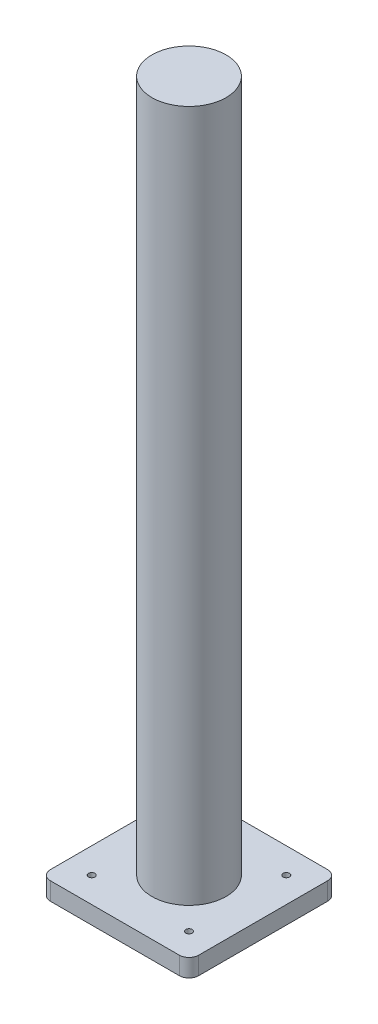
ISO-10303-21;
HEADER;
FILE_DESCRIPTION(('STEP AP214'),'2;1');
FILE_NAME('part.step','',(''),(''),'','','');
FILE_SCHEMA(('AUTOMOTIVE_DESIGN { 1 0 10303 214 1 1 1 1 }'));
ENDSEC;
DATA;
#1=APPLICATION_CONTEXT('core data for automotive mechanical design processes');
#2=APPLICATION_PROTOCOL_DEFINITION('international standard','automotive_design',2000,#1);
#3=PRODUCT_CONTEXT('',#1,'mechanical');
#4=PRODUCT('Part','Part','',(#3));
#5=PRODUCT_RELATED_PRODUCT_CATEGORY('part','',(#4));
#6=PRODUCT_DEFINITION_FORMATION('','',#4);
#7=PRODUCT_DEFINITION_CONTEXT('part definition',#1,'design');
#8=PRODUCT_DEFINITION('design','',#6,#7);
#9=PRODUCT_DEFINITION_SHAPE('','',#8);
#10=(LENGTH_UNIT() NAMED_UNIT(*) SI_UNIT(.MILLI.,.METRE.));
#11=(NAMED_UNIT(*) PLANE_ANGLE_UNIT() SI_UNIT($,.RADIAN.));
#12=(NAMED_UNIT(*) SI_UNIT($,.STERADIAN.) SOLID_ANGLE_UNIT());
#13=UNCERTAINTY_MEASURE_WITH_UNIT(LENGTH_MEASURE(1.E-05),#10,'distance_accuracy_value','');
#14=(GEOMETRIC_REPRESENTATION_CONTEXT(3) GLOBAL_UNCERTAINTY_ASSIGNED_CONTEXT((#13)) GLOBAL_UNIT_ASSIGNED_CONTEXT((#10,
#11,#12)) REPRESENTATION_CONTEXT('',''));
#15=CARTESIAN_POINT('',(0.,0.,0.));
#16=DIRECTION('',(0.,0.,1.));
#17=DIRECTION('',(1.,0.,0.));
#18=AXIS2_PLACEMENT_3D('',#15,#16,#17);
#19=CARTESIAN_POINT('',(0.,9.144,0.));
#20=DIRECTION('',(1.,0.,0.));
#21=DIRECTION('',(0.,0.,-1.));
#22=AXIS2_PLACEMENT_3D('',#19,#20,#21);
#23=PLANE('',#22);
#24=DIRECTION('',(0.,0.,1.));
#25=VECTOR('',#24,1.);
#26=CARTESIAN_POINT('',(0.,9.144,0.));
#27=LINE('',#26,#25);
#28=CARTESIAN_POINT('',(0.,9.144,-71.2));
#29=VERTEX_POINT('',#28);
#30=CARTESIAN_POINT('',(0.,9.144,-5.));
#31=VERTEX_POINT('',#30);
#32=EDGE_CURVE('E130',#29,#31,#27,.T.);
#33=ORIENTED_EDGE('',*,*,#32,.F.);
#34=DIRECTION('',(0.,-1.,0.));
#35=VECTOR('',#34,1.);
#36=CARTESIAN_POINT('',(0.,9.144,-71.2));
#37=LINE('',#36,#35);
#38=CARTESIAN_POINT('',(0.,0.,-71.2));
#39=VERTEX_POINT('',#38);
#40=EDGE_CURVE('E115',#29,#39,#37,.T.);
#41=ORIENTED_EDGE('',*,*,#40,.T.);
#42=DIRECTION('',(0.,0.,1.));
#43=VECTOR('',#42,1.);
#44=CARTESIAN_POINT('',(0.,0.,0.));
#45=LINE('',#44,#43);
#46=CARTESIAN_POINT('',(0.,0.,-5.));
#47=VERTEX_POINT('',#46);
#48=EDGE_CURVE('E127',#39,#47,#45,.T.);
#49=ORIENTED_EDGE('',*,*,#48,.T.);
#50=DIRECTION('',(0.,-1.,0.));
#51=VECTOR('',#50,1.);
#52=CARTESIAN_POINT('',(0.,9.144,-5.));
#53=LINE('',#52,#51);
#54=EDGE_CURVE('E132',#47,#31,#53,.F.);
#55=ORIENTED_EDGE('',*,*,#54,.T.);
#56=EDGE_LOOP('',(#33,#41,#49,#55));
#57=FACE_BOUND('',#56,.T.);
#58=ADVANCED_FACE('F45',(#57),#23,.F.);
#59=CARTESIAN_POINT('',(0.,9.144,0.));
#60=DIRECTION('',(0.,0.,-1.));
#61=DIRECTION('',(-1.,0.,0.));
#62=AXIS2_PLACEMENT_3D('',#59,#60,#61);
#63=PLANE('',#62);
#64=DIRECTION('',(1.,0.,0.));
#65=VECTOR('',#64,1.);
#66=CARTESIAN_POINT('',(0.,0.,0.));
#67=LINE('',#66,#65);
#68=CARTESIAN_POINT('',(5.,0.,0.));
#69=VERTEX_POINT('',#68);
#70=CARTESIAN_POINT('',(71.2,0.,0.));
#71=VERTEX_POINT('',#70);
#72=EDGE_CURVE('E136',#69,#71,#67,.T.);
#73=ORIENTED_EDGE('',*,*,#72,.T.);
#74=DIRECTION('',(0.,-1.,0.));
#75=VECTOR('',#74,1.);
#76=CARTESIAN_POINT('',(71.2,9.144,0.));
#77=LINE('',#76,#75);
#78=CARTESIAN_POINT('',(71.2,9.144,0.));
#79=VERTEX_POINT('',#78);
#80=EDGE_CURVE('E11',#71,#79,#77,.F.);
#81=ORIENTED_EDGE('',*,*,#80,.T.);
#82=DIRECTION('',(1.,0.,0.));
#83=VECTOR('',#82,1.);
#84=CARTESIAN_POINT('',(0.,9.144,0.));
#85=LINE('',#84,#83);
#86=CARTESIAN_POINT('',(5.,9.144,0.));
#87=VERTEX_POINT('',#86);
#88=EDGE_CURVE('E179',#87,#79,#85,.T.);
#89=ORIENTED_EDGE('',*,*,#88,.F.);
#90=DIRECTION('',(0.,-1.,0.));
#91=VECTOR('',#90,1.);
#92=CARTESIAN_POINT('',(5.,9.144,0.));
#93=LINE('',#92,#91);
#94=EDGE_CURVE('E53',#87,#69,#93,.T.);
#95=ORIENTED_EDGE('',*,*,#94,.T.);
#96=EDGE_LOOP('',(#73,#81,#89,#95));
#97=FACE_BOUND('',#96,.T.);
#98=ADVANCED_FACE('F177',(#97),#63,.F.);
#99=CARTESIAN_POINT('',(76.2,9.144,0.));
#100=DIRECTION('',(-1.,0.,0.));
#101=DIRECTION('',(0.,0.,1.));
#102=AXIS2_PLACEMENT_3D('',#99,#100,#101);
#103=PLANE('',#102);
#104=DIRECTION('',(0.,0.,-1.));
#105=VECTOR('',#104,1.);
#106=CARTESIAN_POINT('',(76.2,0.,0.));
#107=LINE('',#106,#105);
#108=CARTESIAN_POINT('',(76.2,0.,-5.));
#109=VERTEX_POINT('',#108);
#110=CARTESIAN_POINT('',(76.2,0.,-71.2));
#111=VERTEX_POINT('',#110);
#112=EDGE_CURVE('E140',#109,#111,#107,.T.);
#113=ORIENTED_EDGE('',*,*,#112,.T.);
#114=DIRECTION('',(0.,-1.,0.));
#115=VECTOR('',#114,1.);
#116=CARTESIAN_POINT('',(76.2,9.144,-71.2));
#117=LINE('',#116,#115);
#118=CARTESIAN_POINT('',(76.2,9.144,-71.2));
#119=VERTEX_POINT('',#118);
#120=EDGE_CURVE('E60',#111,#119,#117,.F.);
#121=ORIENTED_EDGE('',*,*,#120,.T.);
#122=DIRECTION('',(0.,0.,-1.));
#123=VECTOR('',#122,1.);
#124=CARTESIAN_POINT('',(76.2,9.144,0.));
#125=LINE('',#124,#123);
#126=CARTESIAN_POINT('',(76.2,9.144,-5.));
#127=VERTEX_POINT('',#126);
#128=EDGE_CURVE('E187',#127,#119,#125,.T.);
#129=ORIENTED_EDGE('',*,*,#128,.F.);
#130=DIRECTION('',(0.,-1.,0.));
#131=VECTOR('',#130,1.);
#132=CARTESIAN_POINT('',(76.2,9.144,-5.));
#133=LINE('',#132,#131);
#134=EDGE_CURVE('E170',#127,#109,#133,.T.);
#135=ORIENTED_EDGE('',*,*,#134,.T.);
#136=EDGE_LOOP('',(#113,#121,#129,#135));
#137=FACE_BOUND('',#136,.T.);
#138=ADVANCED_FACE('F186',(#137),#103,.F.);
#139=CARTESIAN_POINT('',(0.,9.144,-76.2));
#140=DIRECTION('',(0.,0.,1.));
#141=DIRECTION('',(1.,0.,0.));
#142=AXIS2_PLACEMENT_3D('',#139,#140,#141);
#143=PLANE('',#142);
#144=DIRECTION('',(-1.,0.,0.));
#145=VECTOR('',#144,1.);
#146=CARTESIAN_POINT('',(0.,0.,-76.2));
#147=LINE('',#146,#145);
#148=CARTESIAN_POINT('',(71.2,0.,-76.2));
#149=VERTEX_POINT('',#148);
#150=CARTESIAN_POINT('',(5.,0.,-76.2));
#151=VERTEX_POINT('',#150);
#152=EDGE_CURVE('E150',#149,#151,#147,.T.);
#153=ORIENTED_EDGE('',*,*,#152,.T.);
#154=DIRECTION('',(0.,-1.,0.));
#155=VECTOR('',#154,1.);
#156=CARTESIAN_POINT('',(5.,9.144,-76.2));
#157=LINE('',#156,#155);
#158=CARTESIAN_POINT('',(5.,9.144,-76.2));
#159=VERTEX_POINT('',#158);
#160=EDGE_CURVE('E116',#151,#159,#157,.F.);
#161=ORIENTED_EDGE('',*,*,#160,.T.);
#162=DIRECTION('',(-1.,0.,0.));
#163=VECTOR('',#162,1.);
#164=CARTESIAN_POINT('',(0.,9.144,-76.2));
#165=LINE('',#164,#163);
#166=CARTESIAN_POINT('',(71.2,9.144,-76.2));
#167=VERTEX_POINT('',#166);
#168=EDGE_CURVE('E146',#167,#159,#165,.T.);
#169=ORIENTED_EDGE('',*,*,#168,.F.);
#170=DIRECTION('',(0.,-1.,0.));
#171=VECTOR('',#170,1.);
#172=CARTESIAN_POINT('',(71.2,9.144,-76.2));
#173=LINE('',#172,#171);
#174=EDGE_CURVE('E121',#167,#149,#173,.T.);
#175=ORIENTED_EDGE('',*,*,#174,.T.);
#176=EDGE_LOOP('',(#153,#161,#169,#175));
#177=FACE_BOUND('',#176,.T.);
#178=ADVANCED_FACE('F229',(#177),#143,.F.);
#179=CARTESIAN_POINT('',(0.,9.144,0.));
#180=DIRECTION('',(0.,-1.,0.));
#181=DIRECTION('',(0.,0.,-1.));
#182=AXIS2_PLACEMENT_3D('',#179,#180,#181);
#183=PLANE('',#182);
#184=CARTESIAN_POINT('',(38.1,9.14399999999999,-38.1));
#185=DIRECTION('',(0.,-1.,0.));
#186=DIRECTION('',(0.,0.,-1.));
#187=AXIS2_PLACEMENT_3D('',#184,#185,#186);
#188=CIRCLE('',#187,19.05);
#189=CARTESIAN_POINT('',(38.1,9.14399999999999,-57.15));
#190=VERTEX_POINT('',#189);
#191=EDGE_CURVE('E152',#190,#190,#188,.F.);
#192=ORIENTED_EDGE('',*,*,#191,.F.);
#193=EDGE_LOOP('',(#192));
#194=FACE_BOUND('',#193,.T.);
#195=CARTESIAN_POINT('',(13.1,9.144,-63.1));
#196=DIRECTION('',(0.,1.,0.));
#197=DIRECTION('',(0.,0.,1.));
#198=AXIS2_PLACEMENT_3D('',#195,#196,#197);
#199=CIRCLE('',#198,1.65);
#200=CARTESIAN_POINT('',(13.1,9.144,-61.45));
#201=VERTEX_POINT('',#200);
#202=EDGE_CURVE('E203',#201,#201,#199,.T.);
#203=ORIENTED_EDGE('',*,*,#202,.F.);
#204=EDGE_LOOP('',(#203));
#205=FACE_BOUND('',#204,.T.);
#206=CARTESIAN_POINT('',(63.1,9.144,-13.1));
#207=DIRECTION('',(0.,1.,0.));
#208=DIRECTION('',(0.,0.,1.));
#209=AXIS2_PLACEMENT_3D('',#206,#207,#208);
#210=CIRCLE('',#209,1.65);
#211=CARTESIAN_POINT('',(63.1,9.144,-11.45));
#212=VERTEX_POINT('',#211);
#213=EDGE_CURVE('E196',#212,#212,#210,.T.);
#214=ORIENTED_EDGE('',*,*,#213,.F.);
#215=EDGE_LOOP('',(#214));
#216=FACE_BOUND('',#215,.T.);
#217=CARTESIAN_POINT('',(13.1,9.144,-13.1));
#218=DIRECTION('',(0.,1.,0.));
#219=DIRECTION('',(0.,0.,1.));
#220=AXIS2_PLACEMENT_3D('',#217,#218,#219);
#221=CIRCLE('',#220,1.65);
#222=CARTESIAN_POINT('',(13.1,9.144,-11.45));
#223=VERTEX_POINT('',#222);
#224=EDGE_CURVE('E208',#223,#223,#221,.T.);
#225=ORIENTED_EDGE('',*,*,#224,.F.);
#226=EDGE_LOOP('',(#225));
#227=FACE_BOUND('',#226,.T.);
#228=CARTESIAN_POINT('',(63.1,9.144,-63.1));
#229=DIRECTION('',(0.,1.,0.));
#230=DIRECTION('',(0.,0.,1.));
#231=AXIS2_PLACEMENT_3D('',#228,#229,#230);
#232=CIRCLE('',#231,1.65);
#233=CARTESIAN_POINT('',(63.1,9.144,-61.45));
#234=VERTEX_POINT('',#233);
#235=EDGE_CURVE('E143',#234,#234,#232,.T.);
#236=ORIENTED_EDGE('',*,*,#235,.F.);
#237=EDGE_LOOP('',(#236));
#238=FACE_BOUND('',#237,.T.);
#239=ORIENTED_EDGE('',*,*,#168,.T.);
#240=CARTESIAN_POINT('',(5.,9.144,-71.2));
#241=DIRECTION('',(0.,-1.,0.));
#242=DIRECTION('',(0.,0.,-1.));
#243=AXIS2_PLACEMENT_3D('',#240,#241,#242);
#244=CIRCLE('',#243,5.);
#245=EDGE_CURVE('E168',#159,#29,#244,.F.);
#246=ORIENTED_EDGE('',*,*,#245,.T.);
#247=ORIENTED_EDGE('',*,*,#32,.T.);
#248=CARTESIAN_POINT('',(5.,9.144,-5.));
#249=DIRECTION('',(0.,-1.,0.));
#250=DIRECTION('',(0.,0.,-1.));
#251=AXIS2_PLACEMENT_3D('',#248,#249,#250);
#252=CIRCLE('',#251,5.);
#253=EDGE_CURVE('E163',#31,#87,#252,.F.);
#254=ORIENTED_EDGE('',*,*,#253,.T.);
#255=ORIENTED_EDGE('',*,*,#88,.T.);
#256=CARTESIAN_POINT('',(71.2,9.144,-5.));
#257=DIRECTION('',(0.,-1.,0.));
#258=DIRECTION('',(0.,0.,-1.));
#259=AXIS2_PLACEMENT_3D('',#256,#257,#258);
#260=CIRCLE('',#259,5.);
#261=EDGE_CURVE('E67',#79,#127,#260,.F.);
#262=ORIENTED_EDGE('',*,*,#261,.T.);
#263=ORIENTED_EDGE('',*,*,#128,.T.);
#264=CARTESIAN_POINT('',(71.2,9.144,-71.2));
#265=DIRECTION('',(0.,-1.,0.));
#266=DIRECTION('',(0.,0.,-1.));
#267=AXIS2_PLACEMENT_3D('',#264,#265,#266);
#268=CIRCLE('',#267,5.);
#269=EDGE_CURVE('E166',#119,#167,#268,.F.);
#270=ORIENTED_EDGE('',*,*,#269,.T.);
#271=EDGE_LOOP('',(#239,#246,#247,#254,#255,#262,#263,#270));
#272=FACE_BOUND('',#271,.T.);
#273=ADVANCED_FACE('F226',(#194,#205,#216,#227,#238,#272),#183,.F.);
#274=CARTESIAN_POINT('',(0.,0.,0.));
#275=DIRECTION('',(0.,-1.,0.));
#276=DIRECTION('',(0.,0.,-1.));
#277=AXIS2_PLACEMENT_3D('',#274,#275,#276);
#278=PLANE('',#277);
#279=CARTESIAN_POINT('',(13.1,0.,-63.1));
#280=DIRECTION('',(0.,1.,0.));
#281=DIRECTION('',(0.,0.,1.));
#282=AXIS2_PLACEMENT_3D('',#279,#280,#281);
#283=CIRCLE('',#282,1.65);
#284=CARTESIAN_POINT('',(13.1,0.,-61.45));
#285=VERTEX_POINT('',#284);
#286=EDGE_CURVE('E194',#285,#285,#283,.T.);
#287=ORIENTED_EDGE('',*,*,#286,.T.);
#288=EDGE_LOOP('',(#287));
#289=FACE_BOUND('',#288,.T.);
#290=CARTESIAN_POINT('',(63.1,0.,-13.1));
#291=DIRECTION('',(0.,1.,0.));
#292=DIRECTION('',(0.,0.,1.));
#293=AXIS2_PLACEMENT_3D('',#290,#291,#292);
#294=CIRCLE('',#293,1.65);
#295=CARTESIAN_POINT('',(63.1,0.,-11.45));
#296=VERTEX_POINT('',#295);
#297=EDGE_CURVE('E199',#296,#296,#294,.T.);
#298=ORIENTED_EDGE('',*,*,#297,.T.);
#299=EDGE_LOOP('',(#298));
#300=FACE_BOUND('',#299,.T.);
#301=CARTESIAN_POINT('',(13.1,0.,-13.1));
#302=DIRECTION('',(0.,1.,0.));
#303=DIRECTION('',(0.,0.,1.));
#304=AXIS2_PLACEMENT_3D('',#301,#302,#303);
#305=CIRCLE('',#304,1.65);
#306=CARTESIAN_POINT('',(13.1,0.,-11.45));
#307=VERTEX_POINT('',#306);
#308=EDGE_CURVE('E200',#307,#307,#305,.T.);
#309=ORIENTED_EDGE('',*,*,#308,.T.);
#310=EDGE_LOOP('',(#309));
#311=FACE_BOUND('',#310,.T.);
#312=CARTESIAN_POINT('',(63.1,0.,-63.1));
#313=DIRECTION('',(0.,1.,0.));
#314=DIRECTION('',(0.,0.,1.));
#315=AXIS2_PLACEMENT_3D('',#312,#313,#314);
#316=CIRCLE('',#315,1.65);
#317=CARTESIAN_POINT('',(63.1,0.,-61.45));
#318=VERTEX_POINT('',#317);
#319=EDGE_CURVE('E137',#318,#318,#316,.T.);
#320=ORIENTED_EDGE('',*,*,#319,.T.);
#321=EDGE_LOOP('',(#320));
#322=FACE_BOUND('',#321,.T.);
#323=ORIENTED_EDGE('',*,*,#48,.F.);
#324=CARTESIAN_POINT('',(5.,0.,-71.2));
#325=DIRECTION('',(0.,-1.,0.));
#326=DIRECTION('',(0.,0.,-1.));
#327=AXIS2_PLACEMENT_3D('',#324,#325,#326);
#328=CIRCLE('',#327,5.);
#329=EDGE_CURVE('E111',#39,#151,#328,.T.);
#330=ORIENTED_EDGE('',*,*,#329,.T.);
#331=ORIENTED_EDGE('',*,*,#152,.F.);
#332=CARTESIAN_POINT('',(71.2,0.,-71.2));
#333=DIRECTION('',(0.,-1.,0.));
#334=DIRECTION('',(0.,0.,-1.));
#335=AXIS2_PLACEMENT_3D('',#332,#333,#334);
#336=CIRCLE('',#335,5.);
#337=EDGE_CURVE('E122',#149,#111,#336,.T.);
#338=ORIENTED_EDGE('',*,*,#337,.T.);
#339=ORIENTED_EDGE('',*,*,#112,.F.);
#340=CARTESIAN_POINT('',(71.2,0.,-5.));
#341=DIRECTION('',(0.,-1.,0.));
#342=DIRECTION('',(0.,0.,-1.));
#343=AXIS2_PLACEMENT_3D('',#340,#341,#342);
#344=CIRCLE('',#343,5.);
#345=EDGE_CURVE('E157',#109,#71,#344,.T.);
#346=ORIENTED_EDGE('',*,*,#345,.T.);
#347=ORIENTED_EDGE('',*,*,#72,.F.);
#348=CARTESIAN_POINT('',(5.,0.,-5.));
#349=DIRECTION('',(0.,-1.,0.));
#350=DIRECTION('',(0.,0.,-1.));
#351=AXIS2_PLACEMENT_3D('',#348,#349,#350);
#352=CIRCLE('',#351,5.);
#353=EDGE_CURVE('E131',#69,#47,#352,.T.);
#354=ORIENTED_EDGE('',*,*,#353,.T.);
#355=EDGE_LOOP('',(#323,#330,#331,#338,#339,#346,#347,#354));
#356=FACE_BOUND('',#355,.T.);
#357=ADVANCED_FACE('F134',(#289,#300,#311,#322,#356),#278,.T.);
#358=CARTESIAN_POINT('',(63.1,0.,-63.1));
#359=DIRECTION('',(0.,1.,0.));
#360=DIRECTION('',(0.,0.,1.));
#361=AXIS2_PLACEMENT_3D('',#358,#359,#360);
#362=CYLINDRICAL_SURFACE('',#361,1.65);
#363=ORIENTED_EDGE('',*,*,#319,.F.);
#364=EDGE_LOOP('',(#363));
#365=FACE_BOUND('',#364,.T.);
#366=ORIENTED_EDGE('',*,*,#235,.T.);
#367=EDGE_LOOP('',(#366));
#368=FACE_BOUND('',#367,.T.);
#369=ADVANCED_FACE('F262',(#365,#368),#362,.F.);
#370=CARTESIAN_POINT('',(13.1,0.,-13.1));
#371=DIRECTION('',(0.,1.,0.));
#372=DIRECTION('',(0.,0.,1.));
#373=AXIS2_PLACEMENT_3D('',#370,#371,#372);
#374=CYLINDRICAL_SURFACE('',#373,1.65);
#375=ORIENTED_EDGE('',*,*,#308,.F.);
#376=EDGE_LOOP('',(#375));
#377=FACE_BOUND('',#376,.T.);
#378=ORIENTED_EDGE('',*,*,#224,.T.);
#379=EDGE_LOOP('',(#378));
#380=FACE_BOUND('',#379,.T.);
#381=ADVANCED_FACE('F267',(#377,#380),#374,.F.);
#382=CARTESIAN_POINT('',(63.1,0.,-13.1));
#383=DIRECTION('',(0.,1.,0.));
#384=DIRECTION('',(0.,0.,1.));
#385=AXIS2_PLACEMENT_3D('',#382,#383,#384);
#386=CYLINDRICAL_SURFACE('',#385,1.65);
#387=ORIENTED_EDGE('',*,*,#297,.F.);
#388=EDGE_LOOP('',(#387));
#389=FACE_BOUND('',#388,.T.);
#390=ORIENTED_EDGE('',*,*,#213,.T.);
#391=EDGE_LOOP('',(#390));
#392=FACE_BOUND('',#391,.T.);
#393=ADVANCED_FACE('F269',(#389,#392),#386,.F.);
#394=CARTESIAN_POINT('',(13.1,0.,-63.1));
#395=DIRECTION('',(0.,1.,0.));
#396=DIRECTION('',(0.,0.,1.));
#397=AXIS2_PLACEMENT_3D('',#394,#395,#396);
#398=CYLINDRICAL_SURFACE('',#397,1.65);
#399=ORIENTED_EDGE('',*,*,#286,.F.);
#400=EDGE_LOOP('',(#399));
#401=FACE_BOUND('',#400,.T.);
#402=ORIENTED_EDGE('',*,*,#202,.T.);
#403=EDGE_LOOP('',(#402));
#404=FACE_BOUND('',#403,.T.);
#405=ADVANCED_FACE('F222',(#401,#404),#398,.F.);
#406=CARTESIAN_POINT('',(38.1,364.744,-38.1));
#407=DIRECTION('',(0.,-1.,0.));
#408=DIRECTION('',(0.,0.,-1.));
#409=AXIS2_PLACEMENT_3D('',#406,#407,#408);
#410=CYLINDRICAL_SURFACE('',#409,19.05);
#411=CARTESIAN_POINT('',(38.1,364.744,-38.1));
#412=DIRECTION('',(0.,1.,0.));
#413=DIRECTION('',(0.,0.,1.));
#414=AXIS2_PLACEMENT_3D('',#411,#412,#413);
#415=CIRCLE('',#414,19.05);
#416=CARTESIAN_POINT('',(38.1,364.744,-19.05));
#417=VERTEX_POINT('',#416);
#418=EDGE_CURVE('E211',#417,#417,#415,.T.);
#419=ORIENTED_EDGE('',*,*,#418,.F.);
#420=EDGE_LOOP('',(#419));
#421=FACE_BOUND('',#420,.T.);
#422=ORIENTED_EDGE('',*,*,#191,.T.);
#423=EDGE_LOOP('',(#422));
#424=FACE_BOUND('',#423,.T.);
#425=ADVANCED_FACE('F219',(#421,#424),#410,.T.);
#426=CARTESIAN_POINT('',(38.1,364.744,-38.1));
#427=DIRECTION('',(0.,1.,0.));
#428=DIRECTION('',(0.,0.,1.));
#429=AXIS2_PLACEMENT_3D('',#426,#427,#428);
#430=PLANE('',#429);
#431=ORIENTED_EDGE('',*,*,#418,.T.);
#432=EDGE_LOOP('',(#431));
#433=FACE_BOUND('',#432,.T.);
#434=ADVANCED_FACE('F217',(#433),#430,.T.);
#435=CARTESIAN_POINT('',(5.,9.144,-71.2));
#436=DIRECTION('',(0.,-1.,0.));
#437=DIRECTION('',(0.,0.,-1.));
#438=AXIS2_PLACEMENT_3D('',#435,#436,#437);
#439=CYLINDRICAL_SURFACE('',#438,5.);
#440=ORIENTED_EDGE('',*,*,#245,.F.);
#441=ORIENTED_EDGE('',*,*,#160,.F.);
#442=ORIENTED_EDGE('',*,*,#329,.F.);
#443=ORIENTED_EDGE('',*,*,#40,.F.);
#444=EDGE_LOOP('',(#440,#441,#442,#443));
#445=FACE_BOUND('',#444,.T.);
#446=ADVANCED_FACE('F114',(#445),#439,.T.);
#447=CARTESIAN_POINT('',(71.2,9.144,-71.2));
#448=DIRECTION('',(0.,-1.,0.));
#449=DIRECTION('',(0.,0.,-1.));
#450=AXIS2_PLACEMENT_3D('',#447,#448,#449);
#451=CYLINDRICAL_SURFACE('',#450,5.);
#452=ORIENTED_EDGE('',*,*,#269,.F.);
#453=ORIENTED_EDGE('',*,*,#120,.F.);
#454=ORIENTED_EDGE('',*,*,#337,.F.);
#455=ORIENTED_EDGE('',*,*,#174,.F.);
#456=EDGE_LOOP('',(#452,#453,#454,#455));
#457=FACE_BOUND('',#456,.T.);
#458=ADVANCED_FACE('F242',(#457),#451,.T.);
#459=CARTESIAN_POINT('',(71.2,9.144,-5.));
#460=DIRECTION('',(0.,-1.,0.));
#461=DIRECTION('',(0.,0.,-1.));
#462=AXIS2_PLACEMENT_3D('',#459,#460,#461);
#463=CYLINDRICAL_SURFACE('',#462,5.);
#464=ORIENTED_EDGE('',*,*,#261,.F.);
#465=ORIENTED_EDGE('',*,*,#80,.F.);
#466=ORIENTED_EDGE('',*,*,#345,.F.);
#467=ORIENTED_EDGE('',*,*,#134,.F.);
#468=EDGE_LOOP('',(#464,#465,#466,#467));
#469=FACE_BOUND('',#468,.T.);
#470=ADVANCED_FACE('F185',(#469),#463,.T.);
#471=CARTESIAN_POINT('',(5.,9.144,-5.));
#472=DIRECTION('',(0.,-1.,0.));
#473=DIRECTION('',(0.,0.,-1.));
#474=AXIS2_PLACEMENT_3D('',#471,#472,#473);
#475=CYLINDRICAL_SURFACE('',#474,5.);
#476=ORIENTED_EDGE('',*,*,#253,.F.);
#477=ORIENTED_EDGE('',*,*,#54,.F.);
#478=ORIENTED_EDGE('',*,*,#353,.F.);
#479=ORIENTED_EDGE('',*,*,#94,.F.);
#480=EDGE_LOOP('',(#476,#477,#478,#479));
#481=FACE_BOUND('',#480,.T.);
#482=ADVANCED_FACE('F47',(#481),#475,.T.);
#483=CLOSED_SHELL('',(#58,#98,#138,#178,#273,#357,#369,#381,#393,#405,#425,#434,#446,#458,#470,#482));
#484=MANIFOLD_SOLID_BREP('B2',#483);
#485=ADVANCED_BREP_SHAPE_REPRESENTATION('',(#18,#484),#14);
#486=SHAPE_DEFINITION_REPRESENTATION(#9,#485);
ENDSEC;
END-ISO-10303-21;
